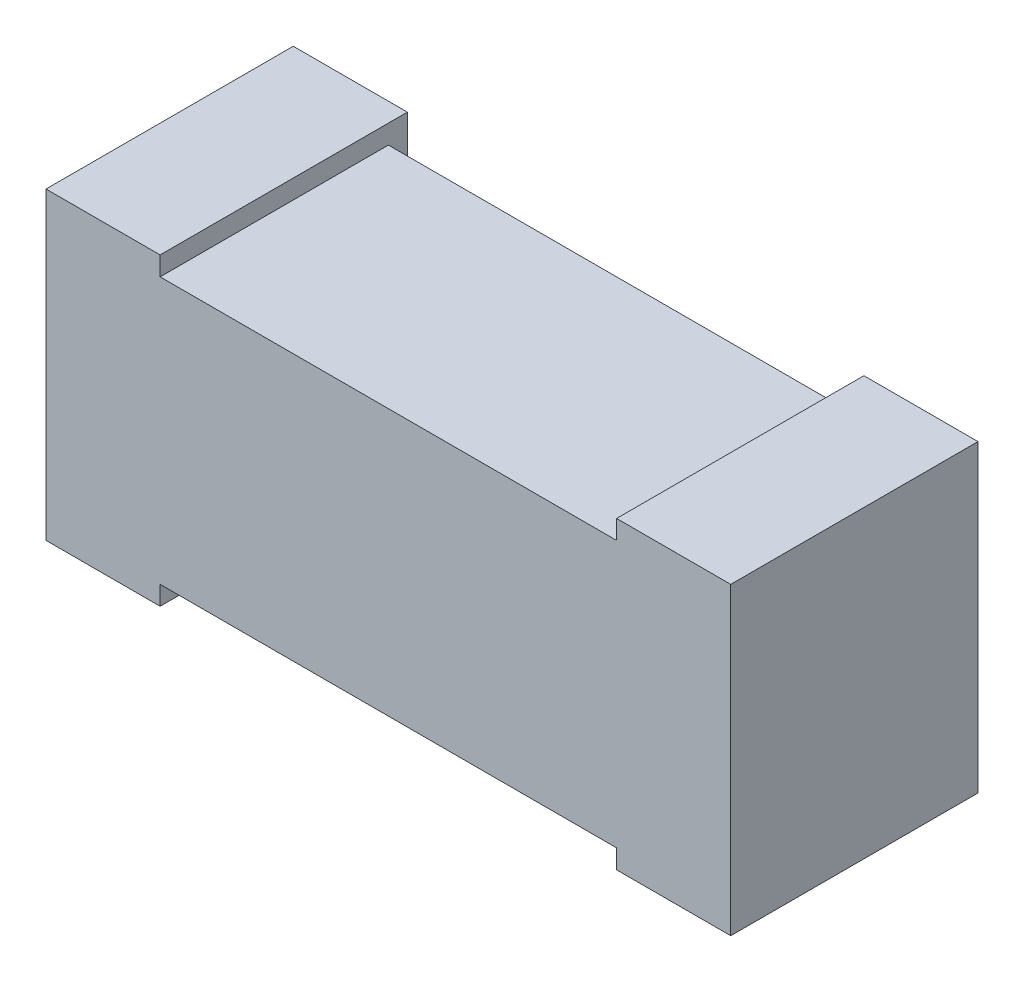
ISO-10303-21;
HEADER;
FILE_DESCRIPTION(('STEP AP214'),'2;1');
FILE_NAME('part.step','',(''),(''),'','','');
FILE_SCHEMA(('AUTOMOTIVE_DESIGN { 1 0 10303 214 1 1 1 1 }'));
ENDSEC;
DATA;
#1=APPLICATION_CONTEXT('core data for automotive mechanical design processes');
#2=APPLICATION_PROTOCOL_DEFINITION('international standard','automotive_design',2000,#1);
#3=PRODUCT_CONTEXT('',#1,'mechanical');
#4=PRODUCT('Part','Part','',(#3));
#5=PRODUCT_RELATED_PRODUCT_CATEGORY('part','',(#4));
#6=PRODUCT_DEFINITION_FORMATION('','',#4);
#7=PRODUCT_DEFINITION_CONTEXT('part definition',#1,'design');
#8=PRODUCT_DEFINITION('design','',#6,#7);
#9=PRODUCT_DEFINITION_SHAPE('','',#8);
#10=(LENGTH_UNIT() NAMED_UNIT(*) SI_UNIT(.MILLI.,.METRE.));
#11=(NAMED_UNIT(*) PLANE_ANGLE_UNIT() SI_UNIT($,.RADIAN.));
#12=(NAMED_UNIT(*) SI_UNIT($,.STERADIAN.) SOLID_ANGLE_UNIT());
#13=UNCERTAINTY_MEASURE_WITH_UNIT(LENGTH_MEASURE(1.E-05),#10,'distance_accuracy_value','');
#14=(GEOMETRIC_REPRESENTATION_CONTEXT(3) GLOBAL_UNCERTAINTY_ASSIGNED_CONTEXT((#13)) GLOBAL_UNIT_ASSIGNED_CONTEXT((#10,
#11,#12)) REPRESENTATION_CONTEXT('',''));
#15=CARTESIAN_POINT('',(0.,0.,0.));
#16=DIRECTION('',(0.,0.,1.));
#17=DIRECTION('',(1.,0.,0.));
#18=AXIS2_PLACEMENT_3D('',#15,#16,#17);
#19=CARTESIAN_POINT('',(-10.401,3.999,-7.65));
#20=DIRECTION('',(0.,0.,-1.));
#21=DIRECTION('',(0.,1.,0.));
#22=AXIS2_PLACEMENT_3D('',#19,#20,#21);
#23=PLANE('',#22);
#24=DIRECTION('',(1.,0.,0.));
#25=VECTOR('',#24,1.);
#26=CARTESIAN_POINT('',(-10.25,4.,-7.65));
#27=LINE('',#26,#25);
#28=CARTESIAN_POINT('',(-10.4,4.,-7.65));
#29=VERTEX_POINT('',#28);
#30=CARTESIAN_POINT('',(-10.1,4.,-7.65));
#31=VERTEX_POINT('',#30);
#32=EDGE_CURVE('E110',#29,#31,#27,.T.);
#33=ORIENTED_EDGE('',*,*,#32,.F.);
#34=DIRECTION('',(0.,-1.,0.));
#35=VECTOR('',#34,1.);
#36=CARTESIAN_POINT('',(-10.4,4.4,-7.65));
#37=LINE('',#36,#35);
#38=CARTESIAN_POINT('',(-10.4,4.8,-7.65));
#39=VERTEX_POINT('',#38);
#40=EDGE_CURVE('E104',#39,#29,#37,.T.);
#41=ORIENTED_EDGE('',*,*,#40,.F.);
#42=DIRECTION('',(-1.,0.,0.));
#43=VECTOR('',#42,1.);
#44=CARTESIAN_POINT('',(-10.25,4.8,-7.65));
#45=LINE('',#44,#43);
#46=CARTESIAN_POINT('',(-10.1,4.8,-7.65));
#47=VERTEX_POINT('',#46);
#48=EDGE_CURVE('E21',#47,#39,#45,.T.);
#49=ORIENTED_EDGE('',*,*,#48,.F.);
#50=DIRECTION('',(0.,1.,0.));
#51=VECTOR('',#50,1.);
#52=CARTESIAN_POINT('',(-10.1,4.4,-7.65));
#53=LINE('',#52,#51);
#54=EDGE_CURVE('E131',#31,#47,#53,.T.);
#55=ORIENTED_EDGE('',*,*,#54,.F.);
#56=EDGE_LOOP('',(#33,#41,#49,#55));
#57=FACE_BOUND('',#56,.T.);
#58=ADVANCED_FACE('F17',(#57),#23,.T.);
#59=CARTESIAN_POINT('',(-10.401,4.8,-6.999));
#60=DIRECTION('',(0.,1.,0.));
#61=DIRECTION('',(1.,0.,0.));
#62=AXIS2_PLACEMENT_3D('',#59,#60,#61);
#63=PLANE('',#62);
#64=DIRECTION('',(0.,0.,1.));
#65=VECTOR('',#64,1.);
#66=CARTESIAN_POINT('',(-10.1,4.8,-7.325));
#67=LINE('',#66,#65);
#68=CARTESIAN_POINT('',(-10.1,4.8,-7.));
#69=VERTEX_POINT('',#68);
#70=EDGE_CURVE('E117',#47,#69,#67,.T.);
#71=ORIENTED_EDGE('',*,*,#70,.F.);
#72=ORIENTED_EDGE('',*,*,#48,.T.);
#73=DIRECTION('',(0.,0.,-1.));
#74=VECTOR('',#73,1.);
#75=CARTESIAN_POINT('',(-10.4,4.8,-7.325));
#76=LINE('',#75,#74);
#77=CARTESIAN_POINT('',(-10.4,4.8,-7.));
#78=VERTEX_POINT('',#77);
#79=EDGE_CURVE('E112',#78,#39,#76,.T.);
#80=ORIENTED_EDGE('',*,*,#79,.F.);
#81=DIRECTION('',(-1.,0.,0.));
#82=VECTOR('',#81,1.);
#83=CARTESIAN_POINT('',(-9.5,4.8,-7.));
#84=LINE('',#83,#82);
#85=EDGE_CURVE('E155',#69,#78,#84,.T.);
#86=ORIENTED_EDGE('',*,*,#85,.F.);
#87=EDGE_LOOP('',(#71,#72,#80,#86));
#88=FACE_BOUND('',#87,.T.);
#89=ADVANCED_FACE('F114',(#88),#63,.T.);
#90=CARTESIAN_POINT('',(-10.4,3.999,-6.999));
#91=DIRECTION('',(-1.,0.,0.));
#92=DIRECTION('',(0.,1.,0.));
#93=AXIS2_PLACEMENT_3D('',#90,#91,#92);
#94=PLANE('',#93);
#95=DIRECTION('',(0.,-1.,0.));
#96=VECTOR('',#95,1.);
#97=CARTESIAN_POINT('',(-10.4,4.4,-7.));
#98=LINE('',#97,#96);
#99=CARTESIAN_POINT('',(-10.4,4.,-7.));
#100=VERTEX_POINT('',#99);
#101=EDGE_CURVE('E121',#78,#100,#98,.T.);
#102=ORIENTED_EDGE('',*,*,#101,.F.);
#103=ORIENTED_EDGE('',*,*,#79,.T.);
#104=ORIENTED_EDGE('',*,*,#40,.T.);
#105=DIRECTION('',(0.,0.,-1.));
#106=VECTOR('',#105,1.);
#107=CARTESIAN_POINT('',(-10.4,4.,-7.325));
#108=LINE('',#107,#106);
#109=EDGE_CURVE('E123',#100,#29,#108,.T.);
#110=ORIENTED_EDGE('',*,*,#109,.F.);
#111=EDGE_LOOP('',(#102,#103,#104,#110));
#112=FACE_BOUND('',#111,.T.);
#113=ADVANCED_FACE('F119',(#112),#94,.T.);
#114=CARTESIAN_POINT('',(-10.099,4.,-6.999));
#115=DIRECTION('',(0.,-1.,0.));
#116=DIRECTION('',(-1.,0.,0.));
#117=AXIS2_PLACEMENT_3D('',#114,#115,#116);
#118=PLANE('',#117);
#119=ORIENTED_EDGE('',*,*,#109,.T.);
#120=ORIENTED_EDGE('',*,*,#32,.T.);
#121=DIRECTION('',(0.,0.,-1.));
#122=VECTOR('',#121,1.);
#123=CARTESIAN_POINT('',(-10.1,4.,-7.325));
#124=LINE('',#123,#122);
#125=CARTESIAN_POINT('',(-10.1,4.,-7.));
#126=VERTEX_POINT('',#125);
#127=EDGE_CURVE('E128',#126,#31,#124,.T.);
#128=ORIENTED_EDGE('',*,*,#127,.F.);
#129=DIRECTION('',(1.,0.,0.));
#130=VECTOR('',#129,1.);
#131=CARTESIAN_POINT('',(-9.5,4.,-7.));
#132=LINE('',#131,#130);
#133=EDGE_CURVE('E158',#100,#126,#132,.T.);
#134=ORIENTED_EDGE('',*,*,#133,.F.);
#135=EDGE_LOOP('',(#119,#120,#128,#134));
#136=FACE_BOUND('',#135,.T.);
#137=ADVANCED_FACE('F228',(#136),#118,.T.);
#138=CARTESIAN_POINT('',(-10.1,4.801,-6.999));
#139=DIRECTION('',(1.,0.,0.));
#140=DIRECTION('',(0.,-1.,0.));
#141=AXIS2_PLACEMENT_3D('',#138,#139,#140);
#142=PLANE('',#141);
#143=ORIENTED_EDGE('',*,*,#70,.T.);
#144=DIRECTION('',(0.,1.,0.));
#145=VECTOR('',#144,1.);
#146=CARTESIAN_POINT('',(-10.1,4.4,-7.));
#147=LINE('',#146,#145);
#148=CARTESIAN_POINT('',(-10.1,4.75,-7.));
#149=VERTEX_POINT('',#148);
#150=EDGE_CURVE('E152',#149,#69,#147,.T.);
#151=ORIENTED_EDGE('',*,*,#150,.F.);
#152=DIRECTION('',(0.,0.,1.));
#153=VECTOR('',#152,1.);
#154=CARTESIAN_POINT('',(-10.1,4.75,-7.3));
#155=LINE('',#154,#153);
#156=CARTESIAN_POINT('',(-10.1,4.75,-7.6));
#157=VERTEX_POINT('',#156);
#158=EDGE_CURVE('E142',#157,#149,#155,.T.);
#159=ORIENTED_EDGE('',*,*,#158,.F.);
#160=DIRECTION('',(0.,1.,0.));
#161=VECTOR('',#160,1.);
#162=CARTESIAN_POINT('',(-10.1,4.4,-7.6));
#163=LINE('',#162,#161);
#164=CARTESIAN_POINT('',(-10.1,4.05,-7.6));
#165=VERTEX_POINT('',#164);
#166=EDGE_CURVE('E139',#165,#157,#163,.T.);
#167=ORIENTED_EDGE('',*,*,#166,.F.);
#168=DIRECTION('',(0.,0.,-1.));
#169=VECTOR('',#168,1.);
#170=CARTESIAN_POINT('',(-10.1,4.05,-7.3));
#171=LINE('',#170,#169);
#172=CARTESIAN_POINT('',(-10.1,4.05,-7.));
#173=VERTEX_POINT('',#172);
#174=EDGE_CURVE('E134',#173,#165,#171,.T.);
#175=ORIENTED_EDGE('',*,*,#174,.F.);
#176=DIRECTION('',(0.,1.,0.));
#177=VECTOR('',#176,1.);
#178=CARTESIAN_POINT('',(-10.1,4.4,-7.));
#179=LINE('',#178,#177);
#180=EDGE_CURVE('E161',#126,#173,#179,.T.);
#181=ORIENTED_EDGE('',*,*,#180,.F.);
#182=ORIENTED_EDGE('',*,*,#127,.T.);
#183=ORIENTED_EDGE('',*,*,#54,.T.);
#184=EDGE_LOOP('',(#143,#151,#159,#167,#175,#181,#182,#183));
#185=FACE_BOUND('',#184,.T.);
#186=ADVANCED_FACE('F224',(#185),#142,.T.);
#187=CARTESIAN_POINT('',(-8.899,4.05,-6.999));
#188=DIRECTION('',(0.,-1.,0.));
#189=DIRECTION('',(-1.,0.,0.));
#190=AXIS2_PLACEMENT_3D('',#187,#188,#189);
#191=PLANE('',#190);
#192=ORIENTED_EDGE('',*,*,#174,.T.);
#193=DIRECTION('',(-1.,0.,0.));
#194=VECTOR('',#193,1.);
#195=CARTESIAN_POINT('',(-9.5,4.05,-7.6));
#196=LINE('',#195,#194);
#197=CARTESIAN_POINT('',(-8.9,4.05,-7.6));
#198=VERTEX_POINT('',#197);
#199=EDGE_CURVE('E136',#198,#165,#196,.T.);
#200=ORIENTED_EDGE('',*,*,#199,.F.);
#201=DIRECTION('',(0.,0.,-1.));
#202=VECTOR('',#201,1.);
#203=CARTESIAN_POINT('',(-8.9,4.05,-7.325));
#204=LINE('',#203,#202);
#205=CARTESIAN_POINT('',(-8.9,4.05,-7.));
#206=VERTEX_POINT('',#205);
#207=EDGE_CURVE('E169',#206,#198,#204,.T.);
#208=ORIENTED_EDGE('',*,*,#207,.F.);
#209=DIRECTION('',(1.,0.,0.));
#210=VECTOR('',#209,1.);
#211=CARTESIAN_POINT('',(-9.5,4.05,-7.));
#212=LINE('',#211,#210);
#213=EDGE_CURVE('E147',#173,#206,#212,.T.);
#214=ORIENTED_EDGE('',*,*,#213,.F.);
#215=EDGE_LOOP('',(#192,#200,#208,#214));
#216=FACE_BOUND('',#215,.T.);
#217=ADVANCED_FACE('F232',(#216),#191,.T.);
#218=CARTESIAN_POINT('',(-10.101,4.049,-7.6));
#219=DIRECTION('',(0.,0.,-1.));
#220=DIRECTION('',(0.,1.,0.));
#221=AXIS2_PLACEMENT_3D('',#218,#219,#220);
#222=PLANE('',#221);
#223=ORIENTED_EDGE('',*,*,#199,.T.);
#224=ORIENTED_EDGE('',*,*,#166,.T.);
#225=DIRECTION('',(-1.,0.,0.));
#226=VECTOR('',#225,1.);
#227=CARTESIAN_POINT('',(-9.5,4.75,-7.6));
#228=LINE('',#227,#226);
#229=CARTESIAN_POINT('',(-8.9,4.75,-7.6));
#230=VERTEX_POINT('',#229);
#231=EDGE_CURVE('E144',#230,#157,#228,.T.);
#232=ORIENTED_EDGE('',*,*,#231,.F.);
#233=DIRECTION('',(0.,1.,0.));
#234=VECTOR('',#233,1.);
#235=CARTESIAN_POINT('',(-8.9,4.4,-7.6));
#236=LINE('',#235,#234);
#237=EDGE_CURVE('E172',#198,#230,#236,.T.);
#238=ORIENTED_EDGE('',*,*,#237,.F.);
#239=EDGE_LOOP('',(#223,#224,#232,#238));
#240=FACE_BOUND('',#239,.T.);
#241=ADVANCED_FACE('F235',(#240),#222,.T.);
#242=CARTESIAN_POINT('',(-10.101,4.75,-6.999));
#243=DIRECTION('',(0.,1.,0.));
#244=DIRECTION('',(1.,0.,0.));
#245=AXIS2_PLACEMENT_3D('',#242,#243,#244);
#246=PLANE('',#245);
#247=DIRECTION('',(0.,0.,1.));
#248=VECTOR('',#247,1.);
#249=CARTESIAN_POINT('',(-8.9,4.75,-7.325));
#250=LINE('',#249,#248);
#251=CARTESIAN_POINT('',(-8.9,4.75,-7.));
#252=VERTEX_POINT('',#251);
#253=EDGE_CURVE('E175',#230,#252,#250,.T.);
#254=ORIENTED_EDGE('',*,*,#253,.F.);
#255=ORIENTED_EDGE('',*,*,#231,.T.);
#256=ORIENTED_EDGE('',*,*,#158,.T.);
#257=DIRECTION('',(-1.,0.,0.));
#258=VECTOR('',#257,1.);
#259=CARTESIAN_POINT('',(-9.5,4.75,-7.));
#260=LINE('',#259,#258);
#261=EDGE_CURVE('E149',#252,#149,#260,.T.);
#262=ORIENTED_EDGE('',*,*,#261,.F.);
#263=EDGE_LOOP('',(#254,#255,#256,#262));
#264=FACE_BOUND('',#263,.T.);
#265=ADVANCED_FACE('F221',(#264),#246,.T.);
#266=CARTESIAN_POINT('',(-10.401,4.801,-7.));
#267=DIRECTION('',(0.,0.,1.));
#268=DIRECTION('',(0.,-1.,0.));
#269=AXIS2_PLACEMENT_3D('',#266,#267,#268);
#270=PLANE('',#269);
#271=ORIENTED_EDGE('',*,*,#133,.T.);
#272=ORIENTED_EDGE('',*,*,#180,.T.);
#273=ORIENTED_EDGE('',*,*,#213,.T.);
#274=DIRECTION('',(0.,1.,0.));
#275=VECTOR('',#274,1.);
#276=CARTESIAN_POINT('',(-8.9,4.4,-7.));
#277=LINE('',#276,#275);
#278=CARTESIAN_POINT('',(-8.9,4.,-7.));
#279=VERTEX_POINT('',#278);
#280=EDGE_CURVE('E166',#279,#206,#277,.T.);
#281=ORIENTED_EDGE('',*,*,#280,.F.);
#282=DIRECTION('',(-1.,0.,0.));
#283=VECTOR('',#282,1.);
#284=CARTESIAN_POINT('',(-8.75,4.,-7.));
#285=LINE('',#284,#283);
#286=CARTESIAN_POINT('',(-8.6,4.,-7.));
#287=VERTEX_POINT('',#286);
#288=EDGE_CURVE('E192',#287,#279,#285,.T.);
#289=ORIENTED_EDGE('',*,*,#288,.F.);
#290=DIRECTION('',(0.,-1.,0.));
#291=VECTOR('',#290,1.);
#292=CARTESIAN_POINT('',(-8.6,4.4,-7.));
#293=LINE('',#292,#291);
#294=CARTESIAN_POINT('',(-8.6,4.8,-7.));
#295=VERTEX_POINT('',#294);
#296=EDGE_CURVE('E186',#295,#287,#293,.T.);
#297=ORIENTED_EDGE('',*,*,#296,.F.);
#298=DIRECTION('',(1.,0.,0.));
#299=VECTOR('',#298,1.);
#300=CARTESIAN_POINT('',(-8.75,4.8,-7.));
#301=LINE('',#300,#299);
#302=CARTESIAN_POINT('',(-8.9,4.8,-7.));
#303=VERTEX_POINT('',#302);
#304=EDGE_CURVE('E181',#303,#295,#301,.T.);
#305=ORIENTED_EDGE('',*,*,#304,.F.);
#306=DIRECTION('',(0.,1.,0.));
#307=VECTOR('',#306,1.);
#308=CARTESIAN_POINT('',(-8.9,4.4,-7.));
#309=LINE('',#308,#307);
#310=EDGE_CURVE('E164',#252,#303,#309,.T.);
#311=ORIENTED_EDGE('',*,*,#310,.F.);
#312=ORIENTED_EDGE('',*,*,#261,.T.);
#313=ORIENTED_EDGE('',*,*,#150,.T.);
#314=ORIENTED_EDGE('',*,*,#85,.T.);
#315=ORIENTED_EDGE('',*,*,#101,.T.);
#316=EDGE_LOOP('',(#271,#272,#273,#281,#289,#297,#305,#311,#312,#313,#314,#315));
#317=FACE_BOUND('',#316,.T.);
#318=ADVANCED_FACE('F212',(#317),#270,.T.);
#319=CARTESIAN_POINT('',(-8.9,3.999,-6.999));
#320=DIRECTION('',(-1.,0.,0.));
#321=DIRECTION('',(0.,1.,0.));
#322=AXIS2_PLACEMENT_3D('',#319,#320,#321);
#323=PLANE('',#322);
#324=ORIENTED_EDGE('',*,*,#237,.T.);
#325=ORIENTED_EDGE('',*,*,#253,.T.);
#326=ORIENTED_EDGE('',*,*,#310,.T.);
#327=DIRECTION('',(0.,0.,1.));
#328=VECTOR('',#327,1.);
#329=CARTESIAN_POINT('',(-8.9,4.8,-7.325));
#330=LINE('',#329,#328);
#331=CARTESIAN_POINT('',(-8.9,4.8,-7.65));
#332=VERTEX_POINT('',#331);
#333=EDGE_CURVE('E178',#332,#303,#330,.T.);
#334=ORIENTED_EDGE('',*,*,#333,.F.);
#335=DIRECTION('',(0.,1.,0.));
#336=VECTOR('',#335,1.);
#337=CARTESIAN_POINT('',(-8.9,4.4,-7.65));
#338=LINE('',#337,#336);
#339=CARTESIAN_POINT('',(-8.9,4.,-7.65));
#340=VERTEX_POINT('',#339);
#341=EDGE_CURVE('E195',#340,#332,#338,.T.);
#342=ORIENTED_EDGE('',*,*,#341,.F.);
#343=DIRECTION('',(0.,0.,-1.));
#344=VECTOR('',#343,1.);
#345=CARTESIAN_POINT('',(-8.9,4.,-7.325));
#346=LINE('',#345,#344);
#347=EDGE_CURVE('E188',#279,#340,#346,.T.);
#348=ORIENTED_EDGE('',*,*,#347,.F.);
#349=ORIENTED_EDGE('',*,*,#280,.T.);
#350=ORIENTED_EDGE('',*,*,#207,.T.);
#351=EDGE_LOOP('',(#324,#325,#326,#334,#342,#348,#349,#350));
#352=FACE_BOUND('',#351,.T.);
#353=ADVANCED_FACE('F217',(#352),#323,.T.);
#354=CARTESIAN_POINT('',(-8.901,4.8,-6.999));
#355=DIRECTION('',(0.,1.,0.));
#356=DIRECTION('',(1.,0.,0.));
#357=AXIS2_PLACEMENT_3D('',#354,#355,#356);
#358=PLANE('',#357);
#359=DIRECTION('',(0.,0.,1.));
#360=VECTOR('',#359,1.);
#361=CARTESIAN_POINT('',(-8.6,4.8,-7.325));
#362=LINE('',#361,#360);
#363=CARTESIAN_POINT('',(-8.6,4.8,-7.65));
#364=VERTEX_POINT('',#363);
#365=EDGE_CURVE('E183',#364,#295,#362,.T.);
#366=ORIENTED_EDGE('',*,*,#365,.F.);
#367=DIRECTION('',(1.,0.,0.));
#368=VECTOR('',#367,1.);
#369=CARTESIAN_POINT('',(-8.75,4.8,-7.65));
#370=LINE('',#369,#368);
#371=EDGE_CURVE('E198',#332,#364,#370,.T.);
#372=ORIENTED_EDGE('',*,*,#371,.F.);
#373=ORIENTED_EDGE('',*,*,#333,.T.);
#374=ORIENTED_EDGE('',*,*,#304,.T.);
#375=EDGE_LOOP('',(#366,#372,#373,#374));
#376=FACE_BOUND('',#375,.T.);
#377=ADVANCED_FACE('F208',(#376),#358,.T.);
#378=CARTESIAN_POINT('',(-8.6,4.801,-6.999));
#379=DIRECTION('',(1.,0.,0.));
#380=DIRECTION('',(0.,-1.,0.));
#381=AXIS2_PLACEMENT_3D('',#378,#379,#380);
#382=PLANE('',#381);
#383=DIRECTION('',(0.,0.,1.));
#384=VECTOR('',#383,1.);
#385=CARTESIAN_POINT('',(-8.6,4.,-7.325));
#386=LINE('',#385,#384);
#387=CARTESIAN_POINT('',(-8.6,4.,-7.65));
#388=VERTEX_POINT('',#387);
#389=EDGE_CURVE('E36',#388,#287,#386,.T.);
#390=ORIENTED_EDGE('',*,*,#389,.F.);
#391=DIRECTION('',(0.,-1.,0.));
#392=VECTOR('',#391,1.);
#393=CARTESIAN_POINT('',(-8.6,4.4,-7.65));
#394=LINE('',#393,#392);
#395=EDGE_CURVE('E27',#364,#388,#394,.T.);
#396=ORIENTED_EDGE('',*,*,#395,.F.);
#397=ORIENTED_EDGE('',*,*,#365,.T.);
#398=ORIENTED_EDGE('',*,*,#296,.T.);
#399=EDGE_LOOP('',(#390,#396,#397,#398));
#400=FACE_BOUND('',#399,.T.);
#401=ADVANCED_FACE('F204',(#400),#382,.T.);
#402=CARTESIAN_POINT('',(-8.599,4.,-6.999));
#403=DIRECTION('',(0.,-1.,0.));
#404=DIRECTION('',(-1.,0.,0.));
#405=AXIS2_PLACEMENT_3D('',#402,#403,#404);
#406=PLANE('',#405);
#407=ORIENTED_EDGE('',*,*,#389,.T.);
#408=ORIENTED_EDGE('',*,*,#288,.T.);
#409=ORIENTED_EDGE('',*,*,#347,.T.);
#410=DIRECTION('',(-1.,0.,0.));
#411=VECTOR('',#410,1.);
#412=CARTESIAN_POINT('',(-8.75,4.,-7.65));
#413=LINE('',#412,#411);
#414=EDGE_CURVE('E11',#388,#340,#413,.T.);
#415=ORIENTED_EDGE('',*,*,#414,.F.);
#416=EDGE_LOOP('',(#407,#408,#409,#415));
#417=FACE_BOUND('',#416,.T.);
#418=ADVANCED_FACE('F215',(#417),#406,.T.);
#419=CARTESIAN_POINT('',(-8.901,3.999,-7.65));
#420=DIRECTION('',(0.,0.,-1.));
#421=DIRECTION('',(0.,1.,0.));
#422=AXIS2_PLACEMENT_3D('',#419,#420,#421);
#423=PLANE('',#422);
#424=ORIENTED_EDGE('',*,*,#395,.T.);
#425=ORIENTED_EDGE('',*,*,#414,.T.);
#426=ORIENTED_EDGE('',*,*,#341,.T.);
#427=ORIENTED_EDGE('',*,*,#371,.T.);
#428=EDGE_LOOP('',(#424,#425,#426,#427));
#429=FACE_BOUND('',#428,.T.);
#430=ADVANCED_FACE('F19',(#429),#423,.T.);
#431=CLOSED_SHELL('',(#58,#89,#113,#137,#186,#217,#241,#265,#318,#353,#377,#401,#418,#430));
#432=MANIFOLD_SOLID_BREP('B1',#431);
#433=ADVANCED_BREP_SHAPE_REPRESENTATION('',(#18,#432),#14);
#434=SHAPE_DEFINITION_REPRESENTATION(#9,#433);
ENDSEC;
END-ISO-10303-21;
